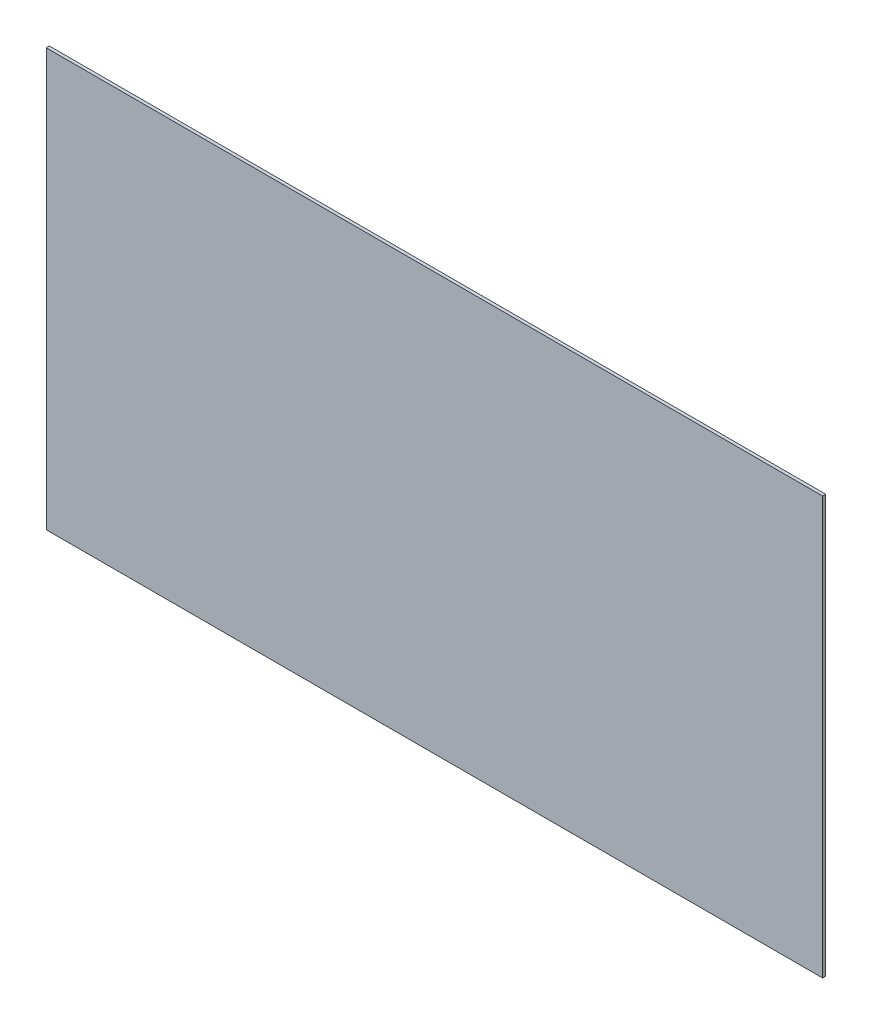
ISO-10303-21;
HEADER;
FILE_DESCRIPTION(('STEP AP214'),'2;1');
FILE_NAME('part.step','',(''),(''),'','','');
FILE_SCHEMA(('AUTOMOTIVE_DESIGN { 1 0 10303 214 1 1 1 1 }'));
ENDSEC;
DATA;
#1=APPLICATION_CONTEXT('core data for automotive mechanical design processes');
#2=APPLICATION_PROTOCOL_DEFINITION('international standard','automotive_design',2000,#1);
#3=PRODUCT_CONTEXT('',#1,'mechanical');
#4=PRODUCT('Part','Part','',(#3));
#5=PRODUCT_RELATED_PRODUCT_CATEGORY('part','',(#4));
#6=PRODUCT_DEFINITION_FORMATION('','',#4);
#7=PRODUCT_DEFINITION_CONTEXT('part definition',#1,'design');
#8=PRODUCT_DEFINITION('design','',#6,#7);
#9=PRODUCT_DEFINITION_SHAPE('','',#8);
#10=(LENGTH_UNIT() NAMED_UNIT(*) SI_UNIT(.MILLI.,.METRE.));
#11=(NAMED_UNIT(*) PLANE_ANGLE_UNIT() SI_UNIT($,.RADIAN.));
#12=(NAMED_UNIT(*) SI_UNIT($,.STERADIAN.) SOLID_ANGLE_UNIT());
#13=UNCERTAINTY_MEASURE_WITH_UNIT(LENGTH_MEASURE(1.E-05),#10,'distance_accuracy_value','');
#14=(GEOMETRIC_REPRESENTATION_CONTEXT(3) GLOBAL_UNCERTAINTY_ASSIGNED_CONTEXT((#13)) GLOBAL_UNIT_ASSIGNED_CONTEXT((#10,
#11,#12)) REPRESENTATION_CONTEXT('',''));
#15=CARTESIAN_POINT('',(0.,0.,0.));
#16=DIRECTION('',(0.,0.,1.));
#17=DIRECTION('',(1.,0.,0.));
#18=AXIS2_PLACEMENT_3D('',#15,#16,#17);
#19=CARTESIAN_POINT('',(0.,0.,1.5));
#20=DIRECTION('',(1.,0.,0.));
#21=DIRECTION('',(0.,0.,-1.));
#22=AXIS2_PLACEMENT_3D('',#19,#20,#21);
#23=PLANE('',#22);
#24=DIRECTION('',(0.,-1.,0.));
#25=VECTOR('',#24,1.);
#26=CARTESIAN_POINT('',(0.,0.,0.));
#27=LINE('',#26,#25);
#28=CARTESIAN_POINT('',(0.,200.,0.));
#29=VERTEX_POINT('',#28);
#30=CARTESIAN_POINT('',(0.,0.,0.));
#31=VERTEX_POINT('',#30);
#32=EDGE_CURVE('E94',#29,#31,#27,.T.);
#33=ORIENTED_EDGE('',*,*,#32,.T.);
#34=DIRECTION('',(0.,0.,-1.));
#35=VECTOR('',#34,1.);
#36=CARTESIAN_POINT('',(0.,0.,1.5));
#37=LINE('',#36,#35);
#38=CARTESIAN_POINT('',(0.,0.,1.5));
#39=VERTEX_POINT('',#38);
#40=EDGE_CURVE('E11',#39,#31,#37,.T.);
#41=ORIENTED_EDGE('',*,*,#40,.F.);
#42=DIRECTION('',(0.,-1.,0.));
#43=VECTOR('',#42,1.);
#44=CARTESIAN_POINT('',(0.,0.,1.5));
#45=LINE('',#44,#43);
#46=CARTESIAN_POINT('',(0.,200.,1.5));
#47=VERTEX_POINT('',#46);
#48=EDGE_CURVE('E82',#47,#39,#45,.T.);
#49=ORIENTED_EDGE('',*,*,#48,.F.);
#50=DIRECTION('',(0.,0.,-1.));
#51=VECTOR('',#50,1.);
#52=CARTESIAN_POINT('',(0.,200.,1.5));
#53=LINE('',#52,#51);
#54=EDGE_CURVE('E90',#47,#29,#53,.T.);
#55=ORIENTED_EDGE('',*,*,#54,.T.);
#56=EDGE_LOOP('',(#33,#41,#49,#55));
#57=FACE_BOUND('',#56,.T.);
#58=ADVANCED_FACE('F31',(#57),#23,.F.);
#59=CARTESIAN_POINT('',(0.,0.,1.5));
#60=DIRECTION('',(0.,1.,0.));
#61=DIRECTION('',(0.,0.,1.));
#62=AXIS2_PLACEMENT_3D('',#59,#60,#61);
#63=PLANE('',#62);
#64=DIRECTION('',(1.,0.,0.));
#65=VECTOR('',#64,1.);
#66=CARTESIAN_POINT('',(0.,0.,0.));
#67=LINE('',#66,#65);
#68=CARTESIAN_POINT('',(372.,0.,0.));
#69=VERTEX_POINT('',#68);
#70=EDGE_CURVE('E86',#31,#69,#67,.T.);
#71=ORIENTED_EDGE('',*,*,#70,.T.);
#72=DIRECTION('',(0.,0.,-1.));
#73=VECTOR('',#72,1.);
#74=CARTESIAN_POINT('',(372.,0.,1.5));
#75=LINE('',#74,#73);
#76=CARTESIAN_POINT('',(372.,0.,1.5));
#77=VERTEX_POINT('',#76);
#78=EDGE_CURVE('E39',#77,#69,#75,.T.);
#79=ORIENTED_EDGE('',*,*,#78,.F.);
#80=DIRECTION('',(1.,0.,0.));
#81=VECTOR('',#80,1.);
#82=CARTESIAN_POINT('',(0.,0.,1.5));
#83=LINE('',#82,#81);
#84=EDGE_CURVE('E77',#39,#77,#83,.T.);
#85=ORIENTED_EDGE('',*,*,#84,.F.);
#86=ORIENTED_EDGE('',*,*,#40,.T.);
#87=EDGE_LOOP('',(#71,#79,#85,#86));
#88=FACE_BOUND('',#87,.T.);
#89=ADVANCED_FACE('F85',(#88),#63,.F.);
#90=CARTESIAN_POINT('',(372.,0.,1.5));
#91=DIRECTION('',(-1.,0.,0.));
#92=DIRECTION('',(0.,0.,1.));
#93=AXIS2_PLACEMENT_3D('',#90,#91,#92);
#94=PLANE('',#93);
#95=DIRECTION('',(0.,1.,0.));
#96=VECTOR('',#95,1.);
#97=CARTESIAN_POINT('',(372.,0.,0.));
#98=LINE('',#97,#96);
#99=CARTESIAN_POINT('',(372.,200.,0.));
#100=VERTEX_POINT('',#99);
#101=EDGE_CURVE('E64',#69,#100,#98,.T.);
#102=ORIENTED_EDGE('',*,*,#101,.T.);
#103=DIRECTION('',(0.,0.,-1.));
#104=VECTOR('',#103,1.);
#105=CARTESIAN_POINT('',(372.,200.,1.5));
#106=LINE('',#105,#104);
#107=CARTESIAN_POINT('',(372.,200.,1.5));
#108=VERTEX_POINT('',#107);
#109=EDGE_CURVE('E87',#108,#100,#106,.T.);
#110=ORIENTED_EDGE('',*,*,#109,.F.);
#111=DIRECTION('',(0.,1.,0.));
#112=VECTOR('',#111,1.);
#113=CARTESIAN_POINT('',(372.,0.,1.5));
#114=LINE('',#113,#112);
#115=EDGE_CURVE('E80',#77,#108,#114,.T.);
#116=ORIENTED_EDGE('',*,*,#115,.F.);
#117=ORIENTED_EDGE('',*,*,#78,.T.);
#118=EDGE_LOOP('',(#102,#110,#116,#117));
#119=FACE_BOUND('',#118,.T.);
#120=ADVANCED_FACE('F88',(#119),#94,.F.);
#121=CARTESIAN_POINT('',(0.,200.,1.5));
#122=DIRECTION('',(0.,-1.,0.));
#123=DIRECTION('',(0.,0.,-1.));
#124=AXIS2_PLACEMENT_3D('',#121,#122,#123);
#125=PLANE('',#124);
#126=DIRECTION('',(-1.,0.,0.));
#127=VECTOR('',#126,1.);
#128=CARTESIAN_POINT('',(0.,200.,0.));
#129=LINE('',#128,#127);
#130=EDGE_CURVE('E70',#100,#29,#129,.T.);
#131=ORIENTED_EDGE('',*,*,#130,.T.);
#132=ORIENTED_EDGE('',*,*,#54,.F.);
#133=DIRECTION('',(-1.,0.,0.));
#134=VECTOR('',#133,1.);
#135=CARTESIAN_POINT('',(0.,200.,1.5));
#136=LINE('',#135,#134);
#137=EDGE_CURVE('E47',#108,#47,#136,.T.);
#138=ORIENTED_EDGE('',*,*,#137,.F.);
#139=ORIENTED_EDGE('',*,*,#109,.T.);
#140=EDGE_LOOP('',(#131,#132,#138,#139));
#141=FACE_BOUND('',#140,.T.);
#142=ADVANCED_FACE('F101',(#141),#125,.F.);
#143=CARTESIAN_POINT('',(0.,200.,1.5));
#144=DIRECTION('',(0.,0.,-1.));
#145=DIRECTION('',(-1.,0.,0.));
#146=AXIS2_PLACEMENT_3D('',#143,#144,#145);
#147=PLANE('',#146);
#148=ORIENTED_EDGE('',*,*,#48,.T.);
#149=ORIENTED_EDGE('',*,*,#84,.T.);
#150=ORIENTED_EDGE('',*,*,#115,.T.);
#151=ORIENTED_EDGE('',*,*,#137,.T.);
#152=EDGE_LOOP('',(#148,#149,#150,#151));
#153=FACE_BOUND('',#152,.T.);
#154=ADVANCED_FACE('F78',(#153),#147,.F.);
#155=CARTESIAN_POINT('',(0.,200.,0.));
#156=DIRECTION('',(0.,0.,-1.));
#157=DIRECTION('',(-1.,0.,0.));
#158=AXIS2_PLACEMENT_3D('',#155,#156,#157);
#159=PLANE('',#158);
#160=ORIENTED_EDGE('',*,*,#32,.F.);
#161=ORIENTED_EDGE('',*,*,#130,.F.);
#162=ORIENTED_EDGE('',*,*,#101,.F.);
#163=ORIENTED_EDGE('',*,*,#70,.F.);
#164=EDGE_LOOP('',(#160,#161,#162,#163));
#165=FACE_BOUND('',#164,.T.);
#166=ADVANCED_FACE('F104',(#165),#159,.T.);
#167=CLOSED_SHELL('',(#58,#89,#120,#142,#154,#166));
#168=MANIFOLD_SOLID_BREP('B2',#167);
#169=ADVANCED_BREP_SHAPE_REPRESENTATION('',(#18,#168),#14);
#170=SHAPE_DEFINITION_REPRESENTATION(#9,#169);
ENDSEC;
END-ISO-10303-21;
